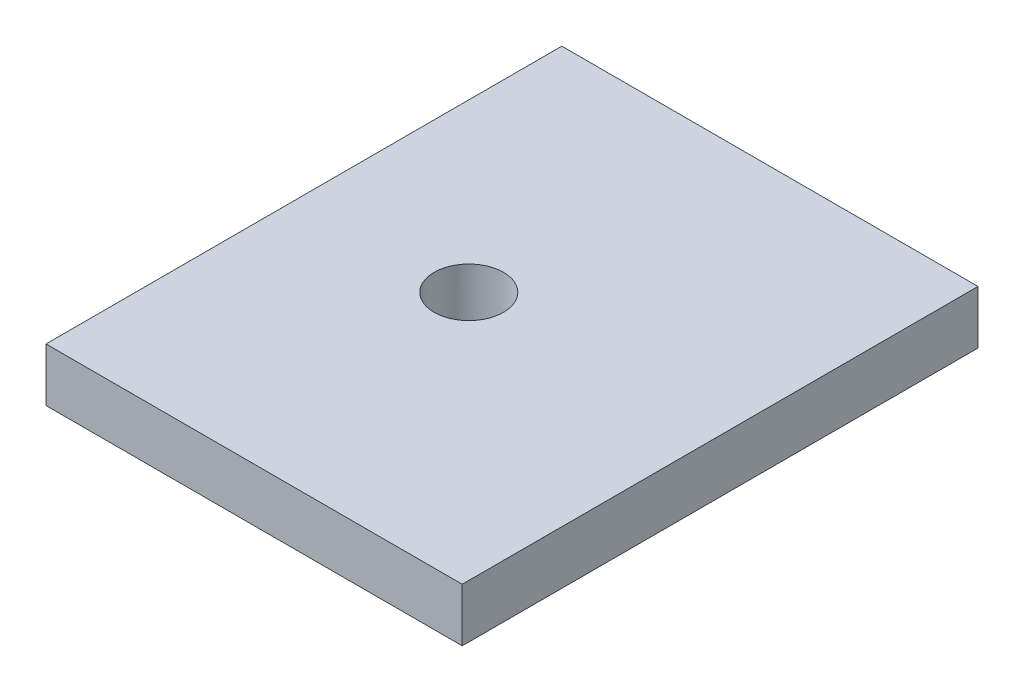
ISO-10303-21;
HEADER;
FILE_DESCRIPTION(('STEP AP214'),'2;1');
FILE_NAME('part.step','',(''),(''),'','','');
FILE_SCHEMA(('AUTOMOTIVE_DESIGN { 1 0 10303 214 1 1 1 1 }'));
ENDSEC;
DATA;
#1=APPLICATION_CONTEXT('core data for automotive mechanical design processes');
#2=APPLICATION_PROTOCOL_DEFINITION('international standard','automotive_design',2000,#1);
#3=PRODUCT_CONTEXT('',#1,'mechanical');
#4=PRODUCT('Part','Part','',(#3));
#5=PRODUCT_RELATED_PRODUCT_CATEGORY('part','',(#4));
#6=PRODUCT_DEFINITION_FORMATION('','',#4);
#7=PRODUCT_DEFINITION_CONTEXT('part definition',#1,'design');
#8=PRODUCT_DEFINITION('design','',#6,#7);
#9=PRODUCT_DEFINITION_SHAPE('','',#8);
#10=(LENGTH_UNIT() NAMED_UNIT(*) SI_UNIT(.MILLI.,.METRE.));
#11=(NAMED_UNIT(*) PLANE_ANGLE_UNIT() SI_UNIT($,.RADIAN.));
#12=(NAMED_UNIT(*) SI_UNIT($,.STERADIAN.) SOLID_ANGLE_UNIT());
#13=UNCERTAINTY_MEASURE_WITH_UNIT(LENGTH_MEASURE(1.E-05),#10,'distance_accuracy_value','');
#14=(GEOMETRIC_REPRESENTATION_CONTEXT(3) GLOBAL_UNCERTAINTY_ASSIGNED_CONTEXT((#13)) GLOBAL_UNIT_ASSIGNED_CONTEXT((#10,
#11,#12)) REPRESENTATION_CONTEXT('',''));
#15=CARTESIAN_POINT('',(0.,0.,0.));
#16=DIRECTION('',(0.,0.,1.));
#17=DIRECTION('',(1.,0.,0.));
#18=AXIS2_PLACEMENT_3D('',#15,#16,#17);
#19=CARTESIAN_POINT('',(0.,3.,0.));
#20=DIRECTION('',(0.,-1.,0.));
#21=DIRECTION('',(0.,0.,-1.));
#22=AXIS2_PLACEMENT_3D('',#19,#20,#21);
#23=PLANE('',#22);
#24=CARTESIAN_POINT('',(-2.32817741662061,3.,0.100000000001585));
#25=DIRECTION('',(0.,1.,0.));
#26=DIRECTION('',(0.,0.,1.));
#27=AXIS2_PLACEMENT_3D('',#24,#25,#26);
#28=CIRCLE('',#27,1.95000000000004);
#29=CARTESIAN_POINT('',(-2.32817741662061,3.,2.05000000000162));
#30=VERTEX_POINT('',#29);
#31=EDGE_CURVE('E112',#30,#30,#28,.T.);
#32=ORIENTED_EDGE('',*,*,#31,.F.);
#33=EDGE_LOOP('',(#32));
#34=FACE_BOUND('',#33,.T.);
#35=DIRECTION('',(0.,0.,-1.));
#36=VECTOR('',#35,1.);
#37=CARTESIAN_POINT('',(11.7,3.,14.5));
#38=LINE('',#37,#36);
#39=CARTESIAN_POINT('',(11.7,3.,14.5));
#40=VERTEX_POINT('',#39);
#41=CARTESIAN_POINT('',(11.7,3.,-14.5));
#42=VERTEX_POINT('',#41);
#43=EDGE_CURVE('E86',#40,#42,#38,.T.);
#44=ORIENTED_EDGE('',*,*,#43,.T.);
#45=DIRECTION('',(-1.,0.,0.));
#46=VECTOR('',#45,1.);
#47=CARTESIAN_POINT('',(-11.7,3.,-14.5));
#48=LINE('',#47,#46);
#49=CARTESIAN_POINT('',(-11.7,3.,-14.5));
#50=VERTEX_POINT('',#49);
#51=EDGE_CURVE('E82',#42,#50,#48,.T.);
#52=ORIENTED_EDGE('',*,*,#51,.T.);
#53=DIRECTION('',(0.,0.,1.));
#54=VECTOR('',#53,1.);
#55=CARTESIAN_POINT('',(-11.7,3.,14.5));
#56=LINE('',#55,#54);
#57=CARTESIAN_POINT('',(-11.7,3.,14.5));
#58=VERTEX_POINT('',#57);
#59=EDGE_CURVE('E84',#50,#58,#56,.T.);
#60=ORIENTED_EDGE('',*,*,#59,.T.);
#61=DIRECTION('',(1.,0.,0.));
#62=VECTOR('',#61,1.);
#63=CARTESIAN_POINT('',(-11.7,3.,14.5));
#64=LINE('',#63,#62);
#65=EDGE_CURVE('E52',#58,#40,#64,.T.);
#66=ORIENTED_EDGE('',*,*,#65,.T.);
#67=EDGE_LOOP('',(#44,#52,#60,#66));
#68=FACE_BOUND('',#67,.T.);
#69=ADVANCED_FACE('F34',(#34,#68),#23,.F.);
#70=CARTESIAN_POINT('',(0.,0.,0.));
#71=DIRECTION('',(0.,-1.,0.));
#72=DIRECTION('',(0.,0.,-1.));
#73=AXIS2_PLACEMENT_3D('',#70,#71,#72);
#74=PLANE('',#73);
#75=CARTESIAN_POINT('',(-2.32817741662061,0.,0.100000000001585));
#76=DIRECTION('',(0.,-1.,0.));
#77=DIRECTION('',(0.,0.,-1.));
#78=AXIS2_PLACEMENT_3D('',#75,#76,#77);
#79=CIRCLE('',#78,1.95000000000004);
#80=CARTESIAN_POINT('',(-2.32817741662061,0.,-1.84999999999845));
#81=VERTEX_POINT('',#80);
#82=EDGE_CURVE('E38',#81,#81,#79,.T.);
#83=ORIENTED_EDGE('',*,*,#82,.F.);
#84=EDGE_LOOP('',(#83));
#85=FACE_BOUND('',#84,.T.);
#86=DIRECTION('',(0.,0.,-1.));
#87=VECTOR('',#86,1.);
#88=CARTESIAN_POINT('',(11.7,0.,14.5));
#89=LINE('',#88,#87);
#90=CARTESIAN_POINT('',(11.7,0.,14.5));
#91=VERTEX_POINT('',#90);
#92=CARTESIAN_POINT('',(11.7,0.,-14.5));
#93=VERTEX_POINT('',#92);
#94=EDGE_CURVE('E99',#91,#93,#89,.T.);
#95=ORIENTED_EDGE('',*,*,#94,.F.);
#96=DIRECTION('',(1.,0.,0.));
#97=VECTOR('',#96,1.);
#98=CARTESIAN_POINT('',(-11.7,0.,14.5));
#99=LINE('',#98,#97);
#100=CARTESIAN_POINT('',(-11.7,0.,14.5));
#101=VERTEX_POINT('',#100);
#102=EDGE_CURVE('E75',#101,#91,#99,.T.);
#103=ORIENTED_EDGE('',*,*,#102,.F.);
#104=DIRECTION('',(0.,0.,1.));
#105=VECTOR('',#104,1.);
#106=CARTESIAN_POINT('',(-11.7,0.,14.5));
#107=LINE('',#106,#105);
#108=CARTESIAN_POINT('',(-11.7,0.,-14.5));
#109=VERTEX_POINT('',#108);
#110=EDGE_CURVE('E69',#109,#101,#107,.T.);
#111=ORIENTED_EDGE('',*,*,#110,.F.);
#112=DIRECTION('',(-1.,0.,0.));
#113=VECTOR('',#112,1.);
#114=CARTESIAN_POINT('',(-11.7,0.,-14.5));
#115=LINE('',#114,#113);
#116=EDGE_CURVE('E90',#93,#109,#115,.T.);
#117=ORIENTED_EDGE('',*,*,#116,.F.);
#118=EDGE_LOOP('',(#95,#103,#111,#117));
#119=FACE_BOUND('',#118,.T.);
#120=ADVANCED_FACE('F109',(#85,#119),#74,.T.);
#121=CARTESIAN_POINT('',(11.7,3.,14.5));
#122=DIRECTION('',(-1.,0.,0.));
#123=DIRECTION('',(0.,0.,1.));
#124=AXIS2_PLACEMENT_3D('',#121,#122,#123);
#125=PLANE('',#124);
#126=ORIENTED_EDGE('',*,*,#94,.T.);
#127=DIRECTION('',(0.,-1.,0.));
#128=VECTOR('',#127,1.);
#129=CARTESIAN_POINT('',(11.7,3.,-14.5));
#130=LINE('',#129,#128);
#131=EDGE_CURVE('E11',#42,#93,#130,.T.);
#132=ORIENTED_EDGE('',*,*,#131,.F.);
#133=ORIENTED_EDGE('',*,*,#43,.F.);
#134=DIRECTION('',(0.,-1.,0.));
#135=VECTOR('',#134,1.);
#136=CARTESIAN_POINT('',(11.7,3.,14.5));
#137=LINE('',#136,#135);
#138=EDGE_CURVE('E95',#40,#91,#137,.T.);
#139=ORIENTED_EDGE('',*,*,#138,.T.);
#140=EDGE_LOOP('',(#126,#132,#133,#139));
#141=FACE_BOUND('',#140,.T.);
#142=ADVANCED_FACE('F36',(#141),#125,.F.);
#143=CARTESIAN_POINT('',(-11.7,3.,-14.5));
#144=DIRECTION('',(0.,0.,1.));
#145=DIRECTION('',(1.,0.,0.));
#146=AXIS2_PLACEMENT_3D('',#143,#144,#145);
#147=PLANE('',#146);
#148=ORIENTED_EDGE('',*,*,#116,.T.);
#149=DIRECTION('',(0.,-1.,0.));
#150=VECTOR('',#149,1.);
#151=CARTESIAN_POINT('',(-11.7,3.,-14.5));
#152=LINE('',#151,#150);
#153=EDGE_CURVE('E44',#50,#109,#152,.T.);
#154=ORIENTED_EDGE('',*,*,#153,.F.);
#155=ORIENTED_EDGE('',*,*,#51,.F.);
#156=ORIENTED_EDGE('',*,*,#131,.T.);
#157=EDGE_LOOP('',(#148,#154,#155,#156));
#158=FACE_BOUND('',#157,.T.);
#159=ADVANCED_FACE('F89',(#158),#147,.F.);
#160=CARTESIAN_POINT('',(-11.7,3.,14.5));
#161=DIRECTION('',(1.,0.,0.));
#162=DIRECTION('',(0.,0.,-1.));
#163=AXIS2_PLACEMENT_3D('',#160,#161,#162);
#164=PLANE('',#163);
#165=ORIENTED_EDGE('',*,*,#110,.T.);
#166=DIRECTION('',(0.,-1.,0.));
#167=VECTOR('',#166,1.);
#168=CARTESIAN_POINT('',(-11.7,3.,14.5));
#169=LINE('',#168,#167);
#170=EDGE_CURVE('E91',#58,#101,#169,.T.);
#171=ORIENTED_EDGE('',*,*,#170,.F.);
#172=ORIENTED_EDGE('',*,*,#59,.F.);
#173=ORIENTED_EDGE('',*,*,#153,.T.);
#174=EDGE_LOOP('',(#165,#171,#172,#173));
#175=FACE_BOUND('',#174,.T.);
#176=ADVANCED_FACE('F93',(#175),#164,.F.);
#177=CARTESIAN_POINT('',(-11.7,3.,14.5));
#178=DIRECTION('',(0.,0.,-1.));
#179=DIRECTION('',(-1.,0.,0.));
#180=AXIS2_PLACEMENT_3D('',#177,#178,#179);
#181=PLANE('',#180);
#182=ORIENTED_EDGE('',*,*,#102,.T.);
#183=ORIENTED_EDGE('',*,*,#138,.F.);
#184=ORIENTED_EDGE('',*,*,#65,.F.);
#185=ORIENTED_EDGE('',*,*,#170,.T.);
#186=EDGE_LOOP('',(#182,#183,#184,#185));
#187=FACE_BOUND('',#186,.T.);
#188=ADVANCED_FACE('F106',(#187),#181,.F.);
#189=CARTESIAN_POINT('',(-2.32817741662061,-7.,0.100000000001585));
#190=DIRECTION('',(0.,1.,0.));
#191=DIRECTION('',(0.,0.,1.));
#192=AXIS2_PLACEMENT_3D('',#189,#190,#191);
#193=CYLINDRICAL_SURFACE('',#192,1.95000000000004);
#194=ORIENTED_EDGE('',*,*,#82,.T.);
#195=EDGE_LOOP('',(#194));
#196=FACE_BOUND('',#195,.T.);
#197=ORIENTED_EDGE('',*,*,#31,.T.);
#198=EDGE_LOOP('',(#197));
#199=FACE_BOUND('',#198,.T.);
#200=ADVANCED_FACE('F119',(#196,#199),#193,.F.);
#201=CLOSED_SHELL('',(#69,#120,#142,#159,#176,#188,#200));
#202=MANIFOLD_SOLID_BREP('B2',#201);
#203=ADVANCED_BREP_SHAPE_REPRESENTATION('',(#18,#202),#14);
#204=SHAPE_DEFINITION_REPRESENTATION(#9,#203);
ENDSEC;
END-ISO-10303-21;
